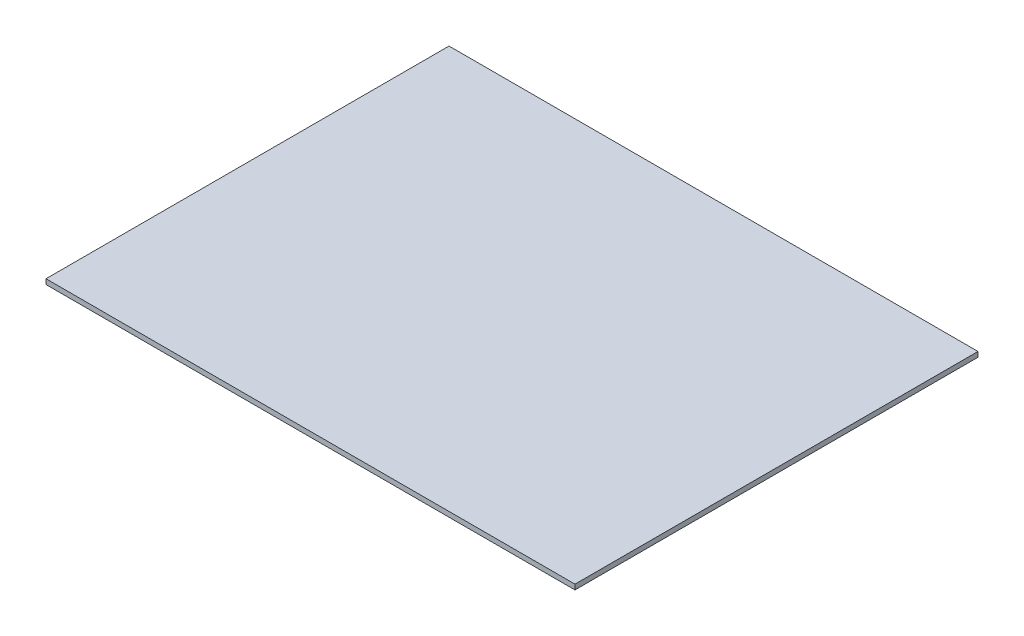
ISO-10303-21;
HEADER;
FILE_DESCRIPTION(('STEP AP214'),'2;1');
FILE_NAME('part.step','',(''),(''),'','','');
FILE_SCHEMA(('AUTOMOTIVE_DESIGN { 1 0 10303 214 1 1 1 1 }'));
ENDSEC;
DATA;
#1=APPLICATION_CONTEXT('core data for automotive mechanical design processes');
#2=APPLICATION_PROTOCOL_DEFINITION('international standard','automotive_design',2000,#1);
#3=PRODUCT_CONTEXT('',#1,'mechanical');
#4=PRODUCT('Part','Part','',(#3));
#5=PRODUCT_RELATED_PRODUCT_CATEGORY('part','',(#4));
#6=PRODUCT_DEFINITION_FORMATION('','',#4);
#7=PRODUCT_DEFINITION_CONTEXT('part definition',#1,'design');
#8=PRODUCT_DEFINITION('design','',#6,#7);
#9=PRODUCT_DEFINITION_SHAPE('','',#8);
#10=(LENGTH_UNIT() NAMED_UNIT(*) SI_UNIT(.MILLI.,.METRE.));
#11=(NAMED_UNIT(*) PLANE_ANGLE_UNIT() SI_UNIT($,.RADIAN.));
#12=(NAMED_UNIT(*) SI_UNIT($,.STERADIAN.) SOLID_ANGLE_UNIT());
#13=UNCERTAINTY_MEASURE_WITH_UNIT(LENGTH_MEASURE(1.E-05),#10,'distance_accuracy_value','');
#14=(GEOMETRIC_REPRESENTATION_CONTEXT(3) GLOBAL_UNCERTAINTY_ASSIGNED_CONTEXT((#13)) GLOBAL_UNIT_ASSIGNED_CONTEXT((#10,
#11,#12)) REPRESENTATION_CONTEXT('',''));
#15=CARTESIAN_POINT('',(0.,0.,0.));
#16=DIRECTION('',(0.,0.,1.));
#17=DIRECTION('',(1.,0.,0.));
#18=AXIS2_PLACEMENT_3D('',#15,#16,#17);
#19=CARTESIAN_POINT('',(0.,2.,0.));
#20=DIRECTION('',(1.,0.,0.));
#21=DIRECTION('',(0.,0.,-1.));
#22=AXIS2_PLACEMENT_3D('',#19,#20,#21);
#23=PLANE('',#22);
#24=DIRECTION('',(0.,0.,1.));
#25=VECTOR('',#24,1.);
#26=CARTESIAN_POINT('',(0.,0.,0.));
#27=LINE('',#26,#25);
#28=CARTESIAN_POINT('',(0.,0.,-160.));
#29=VERTEX_POINT('',#28);
#30=CARTESIAN_POINT('',(0.,0.,0.));
#31=VERTEX_POINT('',#30);
#32=EDGE_CURVE('E98',#29,#31,#27,.T.);
#33=ORIENTED_EDGE('',*,*,#32,.T.);
#34=DIRECTION('',(0.,-1.,0.));
#35=VECTOR('',#34,1.);
#36=CARTESIAN_POINT('',(0.,2.,0.));
#37=LINE('',#36,#35);
#38=CARTESIAN_POINT('',(0.,2.,0.));
#39=VERTEX_POINT('',#38);
#40=EDGE_CURVE('E11',#39,#31,#37,.T.);
#41=ORIENTED_EDGE('',*,*,#40,.F.);
#42=DIRECTION('',(0.,0.,1.));
#43=VECTOR('',#42,1.);
#44=CARTESIAN_POINT('',(0.,2.,0.));
#45=LINE('',#44,#43);
#46=CARTESIAN_POINT('',(0.,2.,-160.));
#47=VERTEX_POINT('',#46);
#48=EDGE_CURVE('E86',#47,#39,#45,.T.);
#49=ORIENTED_EDGE('',*,*,#48,.F.);
#50=DIRECTION('',(0.,-1.,0.));
#51=VECTOR('',#50,1.);
#52=CARTESIAN_POINT('',(0.,2.,-160.));
#53=LINE('',#52,#51);
#54=EDGE_CURVE('E94',#47,#29,#53,.T.);
#55=ORIENTED_EDGE('',*,*,#54,.T.);
#56=EDGE_LOOP('',(#33,#41,#49,#55));
#57=FACE_BOUND('',#56,.T.);
#58=ADVANCED_FACE('F35',(#57),#23,.F.);
#59=CARTESIAN_POINT('',(0.,2.,0.));
#60=DIRECTION('',(0.,0.,-1.));
#61=DIRECTION('',(-1.,0.,0.));
#62=AXIS2_PLACEMENT_3D('',#59,#60,#61);
#63=PLANE('',#62);
#64=DIRECTION('',(1.,0.,0.));
#65=VECTOR('',#64,1.);
#66=CARTESIAN_POINT('',(0.,0.,0.));
#67=LINE('',#66,#65);
#68=CARTESIAN_POINT('',(210.,0.,0.));
#69=VERTEX_POINT('',#68);
#70=EDGE_CURVE('E90',#31,#69,#67,.T.);
#71=ORIENTED_EDGE('',*,*,#70,.T.);
#72=DIRECTION('',(0.,-1.,0.));
#73=VECTOR('',#72,1.);
#74=CARTESIAN_POINT('',(210.,2.,0.));
#75=LINE('',#74,#73);
#76=CARTESIAN_POINT('',(210.,2.,0.));
#77=VERTEX_POINT('',#76);
#78=EDGE_CURVE('E43',#77,#69,#75,.T.);
#79=ORIENTED_EDGE('',*,*,#78,.F.);
#80=DIRECTION('',(1.,0.,0.));
#81=VECTOR('',#80,1.);
#82=CARTESIAN_POINT('',(0.,2.,0.));
#83=LINE('',#82,#81);
#84=EDGE_CURVE('E81',#39,#77,#83,.T.);
#85=ORIENTED_EDGE('',*,*,#84,.F.);
#86=ORIENTED_EDGE('',*,*,#40,.T.);
#87=EDGE_LOOP('',(#71,#79,#85,#86));
#88=FACE_BOUND('',#87,.T.);
#89=ADVANCED_FACE('F89',(#88),#63,.F.);
#90=CARTESIAN_POINT('',(210.,2.,0.));
#91=DIRECTION('',(-1.,0.,0.));
#92=DIRECTION('',(0.,0.,1.));
#93=AXIS2_PLACEMENT_3D('',#90,#91,#92);
#94=PLANE('',#93);
#95=DIRECTION('',(0.,0.,-1.));
#96=VECTOR('',#95,1.);
#97=CARTESIAN_POINT('',(210.,0.,0.));
#98=LINE('',#97,#96);
#99=CARTESIAN_POINT('',(210.,0.,-160.));
#100=VERTEX_POINT('',#99);
#101=EDGE_CURVE('E68',#69,#100,#98,.T.);
#102=ORIENTED_EDGE('',*,*,#101,.T.);
#103=DIRECTION('',(0.,-1.,0.));
#104=VECTOR('',#103,1.);
#105=CARTESIAN_POINT('',(210.,2.,-160.));
#106=LINE('',#105,#104);
#107=CARTESIAN_POINT('',(210.,2.,-160.));
#108=VERTEX_POINT('',#107);
#109=EDGE_CURVE('E91',#108,#100,#106,.T.);
#110=ORIENTED_EDGE('',*,*,#109,.F.);
#111=DIRECTION('',(0.,0.,-1.));
#112=VECTOR('',#111,1.);
#113=CARTESIAN_POINT('',(210.,2.,0.));
#114=LINE('',#113,#112);
#115=EDGE_CURVE('E84',#77,#108,#114,.T.);
#116=ORIENTED_EDGE('',*,*,#115,.F.);
#117=ORIENTED_EDGE('',*,*,#78,.T.);
#118=EDGE_LOOP('',(#102,#110,#116,#117));
#119=FACE_BOUND('',#118,.T.);
#120=ADVANCED_FACE('F92',(#119),#94,.F.);
#121=CARTESIAN_POINT('',(0.,2.,-160.));
#122=DIRECTION('',(0.,0.,1.));
#123=DIRECTION('',(1.,0.,0.));
#124=AXIS2_PLACEMENT_3D('',#121,#122,#123);
#125=PLANE('',#124);
#126=DIRECTION('',(-1.,0.,0.));
#127=VECTOR('',#126,1.);
#128=CARTESIAN_POINT('',(0.,0.,-160.));
#129=LINE('',#128,#127);
#130=EDGE_CURVE('E74',#100,#29,#129,.T.);
#131=ORIENTED_EDGE('',*,*,#130,.T.);
#132=ORIENTED_EDGE('',*,*,#54,.F.);
#133=DIRECTION('',(-1.,0.,0.));
#134=VECTOR('',#133,1.);
#135=CARTESIAN_POINT('',(0.,2.,-160.));
#136=LINE('',#135,#134);
#137=EDGE_CURVE('E51',#108,#47,#136,.T.);
#138=ORIENTED_EDGE('',*,*,#137,.F.);
#139=ORIENTED_EDGE('',*,*,#109,.T.);
#140=EDGE_LOOP('',(#131,#132,#138,#139));
#141=FACE_BOUND('',#140,.T.);
#142=ADVANCED_FACE('F105',(#141),#125,.F.);
#143=CARTESIAN_POINT('',(0.,2.,0.));
#144=DIRECTION('',(0.,-1.,0.));
#145=DIRECTION('',(0.,0.,-1.));
#146=AXIS2_PLACEMENT_3D('',#143,#144,#145);
#147=PLANE('',#146);
#148=ORIENTED_EDGE('',*,*,#48,.T.);
#149=ORIENTED_EDGE('',*,*,#84,.T.);
#150=ORIENTED_EDGE('',*,*,#115,.T.);
#151=ORIENTED_EDGE('',*,*,#137,.T.);
#152=EDGE_LOOP('',(#148,#149,#150,#151));
#153=FACE_BOUND('',#152,.T.);
#154=ADVANCED_FACE('F82',(#153),#147,.F.);
#155=CARTESIAN_POINT('',(0.,0.,0.));
#156=DIRECTION('',(0.,-1.,0.));
#157=DIRECTION('',(0.,0.,-1.));
#158=AXIS2_PLACEMENT_3D('',#155,#156,#157);
#159=PLANE('',#158);
#160=ORIENTED_EDGE('',*,*,#32,.F.);
#161=ORIENTED_EDGE('',*,*,#130,.F.);
#162=ORIENTED_EDGE('',*,*,#101,.F.);
#163=ORIENTED_EDGE('',*,*,#70,.F.);
#164=EDGE_LOOP('',(#160,#161,#162,#163));
#165=FACE_BOUND('',#164,.T.);
#166=ADVANCED_FACE('F108',(#165),#159,.T.);
#167=CLOSED_SHELL('',(#58,#89,#120,#142,#154,#166));
#168=MANIFOLD_SOLID_BREP('B2',#167);
#169=ADVANCED_BREP_SHAPE_REPRESENTATION('',(#18,#168),#14);
#170=SHAPE_DEFINITION_REPRESENTATION(#9,#169);
ENDSEC;
END-ISO-10303-21;
